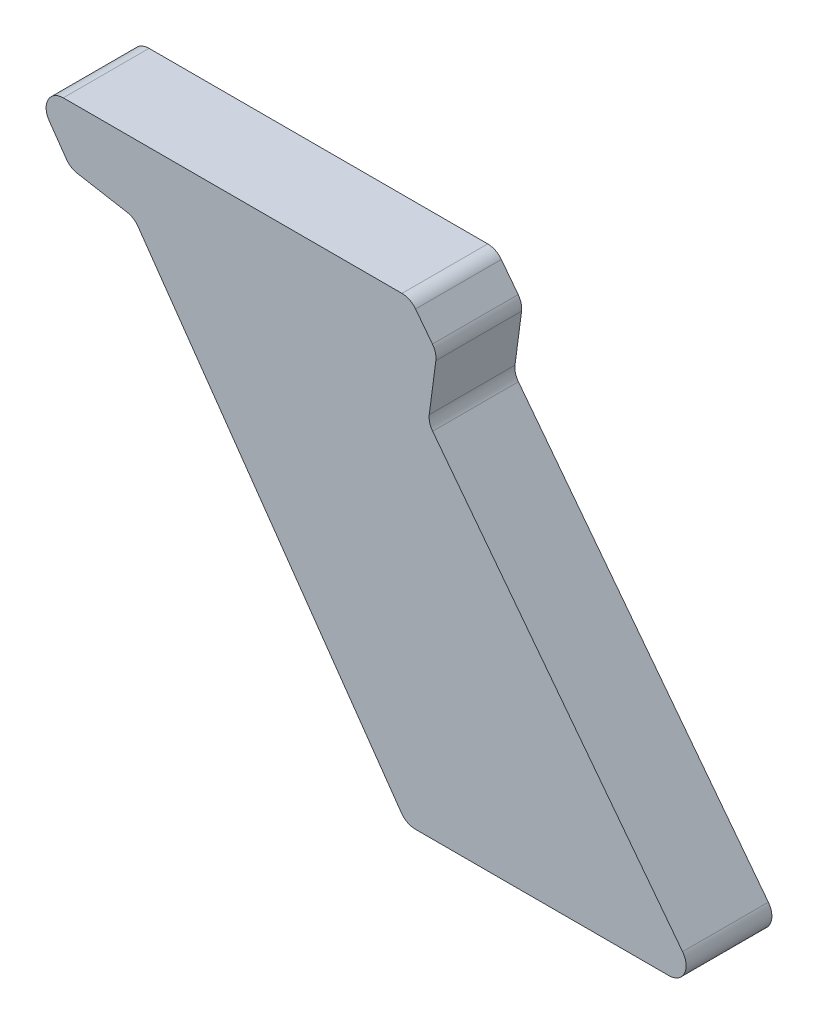
ISO-10303-21;
HEADER;
FILE_DESCRIPTION(('STEP AP214'),'2;1');
FILE_NAME('part.step','',(''),(''),'','','');
FILE_SCHEMA(('AUTOMOTIVE_DESIGN { 1 0 10303 214 1 1 1 1 }'));
ENDSEC;
DATA;
#1=APPLICATION_CONTEXT('core data for automotive mechanical design processes');
#2=APPLICATION_PROTOCOL_DEFINITION('international standard','automotive_design',2000,#1);
#3=PRODUCT_CONTEXT('',#1,'mechanical');
#4=PRODUCT('Part','Part','',(#3));
#5=PRODUCT_RELATED_PRODUCT_CATEGORY('part','',(#4));
#6=PRODUCT_DEFINITION_FORMATION('','',#4);
#7=PRODUCT_DEFINITION_CONTEXT('part definition',#1,'design');
#8=PRODUCT_DEFINITION('design','',#6,#7);
#9=PRODUCT_DEFINITION_SHAPE('','',#8);
#10=(LENGTH_UNIT() NAMED_UNIT(*) SI_UNIT(.MILLI.,.METRE.));
#11=(NAMED_UNIT(*) PLANE_ANGLE_UNIT() SI_UNIT($,.RADIAN.));
#12=(NAMED_UNIT(*) SI_UNIT($,.STERADIAN.) SOLID_ANGLE_UNIT());
#13=UNCERTAINTY_MEASURE_WITH_UNIT(LENGTH_MEASURE(1.E-05),#10,'distance_accuracy_value','');
#14=(GEOMETRIC_REPRESENTATION_CONTEXT(3) GLOBAL_UNCERTAINTY_ASSIGNED_CONTEXT((#13)) GLOBAL_UNIT_ASSIGNED_CONTEXT((#10,
#11,#12)) REPRESENTATION_CONTEXT('',''));
#15=CARTESIAN_POINT('',(0.,0.,0.));
#16=DIRECTION('',(0.,0.,1.));
#17=DIRECTION('',(1.,0.,0.));
#18=AXIS2_PLACEMENT_3D('',#15,#16,#17);
#19=CARTESIAN_POINT('',(-52.7818160043293,77.,15.));
#20=DIRECTION('',(0.,0.,-1.));
#21=DIRECTION('',(-1.,0.,0.));
#22=AXIS2_PLACEMENT_3D('',#19,#20,#21);
#23=CYLINDRICAL_SURFACE('',#22,3.);
#24=CARTESIAN_POINT('',(-52.7818160043293,77.,0.));
#25=DIRECTION('',(0.,0.,1.));
#26=DIRECTION('',(1.,0.,0.));
#27=AXIS2_PLACEMENT_3D('',#24,#25,#26);
#28=CIRCLE('',#27,3.);
#29=CARTESIAN_POINT('',(-50.4017559834556,78.8262842870262,0.));
#30=VERTEX_POINT('',#29);
#31=CARTESIAN_POINT('',(-52.7818160043293,80.,0.));
#32=VERTEX_POINT('',#31);
#33=EDGE_CURVE('E182',#30,#32,#28,.T.);
#34=ORIENTED_EDGE('',*,*,#33,.T.);
#35=DIRECTION('',(0.,0.,-1.));
#36=VECTOR('',#35,1.);
#37=CARTESIAN_POINT('',(-52.7818160043293,80.,15.));
#38=LINE('',#37,#36);
#39=CARTESIAN_POINT('',(-52.7818160043293,80.,15.));
#40=VERTEX_POINT('',#39);
#41=EDGE_CURVE('E11',#40,#32,#38,.T.);
#42=ORIENTED_EDGE('',*,*,#41,.F.);
#43=CARTESIAN_POINT('',(-52.7818160043293,77.,15.));
#44=DIRECTION('',(0.,0.,1.));
#45=DIRECTION('',(1.,0.,0.));
#46=AXIS2_PLACEMENT_3D('',#43,#44,#45);
#47=CIRCLE('',#46,3.);
#48=CARTESIAN_POINT('',(-50.4017559834556,78.8262842870262,15.));
#49=VERTEX_POINT('',#48);
#50=EDGE_CURVE('E212',#49,#40,#47,.T.);
#51=ORIENTED_EDGE('',*,*,#50,.F.);
#52=DIRECTION('',(0.,0.,-1.));
#53=VECTOR('',#52,1.);
#54=CARTESIAN_POINT('',(-50.4017559834556,78.8262842870262,15.));
#55=LINE('',#54,#53);
#56=EDGE_CURVE('E178',#49,#30,#55,.T.);
#57=ORIENTED_EDGE('',*,*,#56,.T.);
#58=EDGE_LOOP('',(#34,#42,#51,#57));
#59=FACE_BOUND('',#58,.T.);
#60=ADVANCED_FACE('F38',(#59),#23,.T.);
#61=CARTESIAN_POINT('',(-52.7818160043293,80.,15.));
#62=DIRECTION('',(0.,-1.,0.));
#63=DIRECTION('',(1.,0.,0.));
#64=AXIS2_PLACEMENT_3D('',#61,#62,#63);
#65=PLANE('',#64);
#66=DIRECTION('',(-1.,0.,0.));
#67=VECTOR('',#66,1.);
#68=CARTESIAN_POINT('',(-52.7818160043293,80.,0.));
#69=LINE('',#68,#67);
#70=CARTESIAN_POINT('',(-112.019853385957,80.,0.));
#71=VERTEX_POINT('',#70);
#72=EDGE_CURVE('E185',#32,#71,#69,.T.);
#73=ORIENTED_EDGE('',*,*,#72,.T.);
#74=DIRECTION('',(0.,0.,-1.));
#75=VECTOR('',#74,1.);
#76=CARTESIAN_POINT('',(-112.019853385957,80.,15.));
#77=LINE('',#76,#75);
#78=CARTESIAN_POINT('',(-112.019853385957,80.,15.));
#79=VERTEX_POINT('',#78);
#80=EDGE_CURVE('E46',#79,#71,#77,.T.);
#81=ORIENTED_EDGE('',*,*,#80,.F.);
#82=DIRECTION('',(-1.,0.,0.));
#83=VECTOR('',#82,1.);
#84=CARTESIAN_POINT('',(-52.7818160043293,80.,15.));
#85=LINE('',#84,#83);
#86=EDGE_CURVE('E121',#40,#79,#85,.T.);
#87=ORIENTED_EDGE('',*,*,#86,.F.);
#88=ORIENTED_EDGE('',*,*,#41,.T.);
#89=EDGE_LOOP('',(#73,#81,#87,#88));
#90=FACE_BOUND('',#89,.T.);
#91=ADVANCED_FACE('F310',(#90),#65,.F.);
#92=CARTESIAN_POINT('',(-112.019853385957,77.,15.));
#93=DIRECTION('',(0.,0.,-1.));
#94=DIRECTION('',(-1.,0.,0.));
#95=AXIS2_PLACEMENT_3D('',#92,#93,#94);
#96=CYLINDRICAL_SURFACE('',#95,2.99999999999999);
#97=CARTESIAN_POINT('',(-112.019853385957,77.,0.));
#98=DIRECTION('',(0.,0.,1.));
#99=DIRECTION('',(1.,0.,0.));
#100=AXIS2_PLACEMENT_3D('',#97,#98,#99);
#101=CIRCLE('',#100,2.99999999999999);
#102=CARTESIAN_POINT('',(-114.477309518823,75.2792706909468,0.));
#103=VERTEX_POINT('',#102);
#104=EDGE_CURVE('E187',#71,#103,#101,.T.);
#105=ORIENTED_EDGE('',*,*,#104,.T.);
#106=DIRECTION('',(0.,0.,-1.));
#107=VECTOR('',#106,1.);
#108=CARTESIAN_POINT('',(-114.477309518823,75.2792706909468,15.));
#109=LINE('',#108,#107);
#110=CARTESIAN_POINT('',(-114.477309518823,75.2792706909468,15.));
#111=VERTEX_POINT('',#110);
#112=EDGE_CURVE('E243',#111,#103,#109,.T.);
#113=ORIENTED_EDGE('',*,*,#112,.F.);
#114=CARTESIAN_POINT('',(-112.019853385957,77.,15.));
#115=DIRECTION('',(0.,0.,1.));
#116=DIRECTION('',(1.,0.,0.));
#117=AXIS2_PLACEMENT_3D('',#114,#115,#116);
#118=CIRCLE('',#117,2.99999999999999);
#119=EDGE_CURVE('E251',#79,#111,#118,.T.);
#120=ORIENTED_EDGE('',*,*,#119,.F.);
#121=ORIENTED_EDGE('',*,*,#80,.T.);
#122=EDGE_LOOP('',(#105,#113,#120,#121));
#123=FACE_BOUND('',#122,.T.);
#124=ADVANCED_FACE('F249',(#123),#96,.T.);
#125=CARTESIAN_POINT('',(-114.477309518823,75.2792706909468,15.));
#126=DIRECTION('',(0.819152044288985,0.573576436351057,0.));
#127=DIRECTION('',(-0.573576436351057,0.819152044288985,0.));
#128=AXIS2_PLACEMENT_3D('',#125,#126,#127);
#129=PLANE('',#128);
#130=DIRECTION('',(0.573576436351056,-0.819152044288984,0.));
#131=VECTOR('',#130,1.);
#132=CARTESIAN_POINT('',(-114.477309518823,75.2792706909468,0.));
#133=LINE('',#132,#131);
#134=CARTESIAN_POINT('',(-111.493473801756,71.0179116591704,0.));
#135=VERTEX_POINT('',#134);
#136=EDGE_CURVE('E189',#103,#135,#133,.T.);
#137=ORIENTED_EDGE('',*,*,#136,.T.);
#138=DIRECTION('',(0.,0.,-1.));
#139=VECTOR('',#138,1.);
#140=CARTESIAN_POINT('',(-111.493473801756,71.0179116591704,15.));
#141=LINE('',#140,#139);
#142=CARTESIAN_POINT('',(-111.493473801756,71.0179116591704,15.));
#143=VERTEX_POINT('',#142);
#144=EDGE_CURVE('E240',#143,#135,#141,.T.);
#145=ORIENTED_EDGE('',*,*,#144,.F.);
#146=DIRECTION('',(0.573576436351056,-0.819152044288984,0.));
#147=VECTOR('',#146,1.);
#148=CARTESIAN_POINT('',(-114.477309518823,75.2792706909468,15.));
#149=LINE('',#148,#147);
#150=EDGE_CURVE('E269',#111,#143,#149,.T.);
#151=ORIENTED_EDGE('',*,*,#150,.F.);
#152=ORIENTED_EDGE('',*,*,#112,.T.);
#153=EDGE_LOOP('',(#137,#145,#151,#152));
#154=FACE_BOUND('',#153,.T.);
#155=ADVANCED_FACE('F260',(#154),#129,.F.);
#156=CARTESIAN_POINT('',(-109.036017668889,72.7386409682236,15.));
#157=DIRECTION('',(0.,0.,-1.));
#158=DIRECTION('',(-1.,0.,0.));
#159=AXIS2_PLACEMENT_3D('',#156,#157,#158);
#160=CYLINDRICAL_SURFACE('',#159,3.);
#161=CARTESIAN_POINT('',(-109.036017668889,72.7386409682236,0.));
#162=DIRECTION('',(0.,0.,1.));
#163=DIRECTION('',(1.,0.,0.));
#164=AXIS2_PLACEMENT_3D('',#161,#162,#163);
#165=CIRCLE('',#164,3.);
#166=CARTESIAN_POINT('',(-109.556962201889,69.784217709187,0.));
#167=VERTEX_POINT('',#166);
#168=EDGE_CURVE('E191',#135,#167,#165,.T.);
#169=ORIENTED_EDGE('',*,*,#168,.T.);
#170=DIRECTION('',(0.,0.,-1.));
#171=VECTOR('',#170,1.);
#172=CARTESIAN_POINT('',(-109.556962201889,69.784217709187,15.));
#173=LINE('',#172,#171);
#174=CARTESIAN_POINT('',(-109.556962201889,69.784217709187,15.));
#175=VERTEX_POINT('',#174);
#176=EDGE_CURVE('E237',#175,#167,#173,.T.);
#177=ORIENTED_EDGE('',*,*,#176,.F.);
#178=CARTESIAN_POINT('',(-109.036017668889,72.7386409682236,15.));
#179=DIRECTION('',(0.,0.,1.));
#180=DIRECTION('',(1.,0.,0.));
#181=AXIS2_PLACEMENT_3D('',#178,#179,#180);
#182=CIRCLE('',#181,3.);
#183=EDGE_CURVE('E266',#143,#175,#182,.T.);
#184=ORIENTED_EDGE('',*,*,#183,.F.);
#185=ORIENTED_EDGE('',*,*,#144,.T.);
#186=EDGE_LOOP('',(#169,#177,#184,#185));
#187=FACE_BOUND('',#186,.T.);
#188=ADVANCED_FACE('F264',(#187),#160,.T.);
#189=CARTESIAN_POINT('',(-109.556962201889,69.784217709187,15.));
#190=DIRECTION('',(0.173648177666915,0.984807753012211,0.));
#191=DIRECTION('',(-0.984807753012211,0.173648177666915,0.));
#192=AXIS2_PLACEMENT_3D('',#189,#190,#191);
#193=PLANE('',#192);
#194=DIRECTION('',(0.984807753012211,-0.173648177666915,0.));
#195=VECTOR('',#194,1.);
#196=CARTESIAN_POINT('',(-109.556962201889,69.784217709187,0.));
#197=LINE('',#196,#195);
#198=CARTESIAN_POINT('',(-100.862658722536,68.2511774273096,0.));
#199=VERTEX_POINT('',#198);
#200=EDGE_CURVE('E193',#167,#199,#197,.T.);
#201=ORIENTED_EDGE('',*,*,#200,.T.);
#202=DIRECTION('',(0.,0.,-1.));
#203=VECTOR('',#202,1.);
#204=CARTESIAN_POINT('',(-100.862658722536,68.2511774273096,15.));
#205=LINE('',#204,#203);
#206=CARTESIAN_POINT('',(-100.862658722536,68.2511774273096,15.));
#207=VERTEX_POINT('',#206);
#208=EDGE_CURVE('E234',#207,#199,#205,.T.);
#209=ORIENTED_EDGE('',*,*,#208,.F.);
#210=DIRECTION('',(0.984807753012211,-0.173648177666915,0.));
#211=VECTOR('',#210,1.);
#212=CARTESIAN_POINT('',(-109.556962201889,69.784217709187,15.));
#213=LINE('',#212,#211);
#214=EDGE_CURVE('E268',#175,#207,#213,.T.);
#215=ORIENTED_EDGE('',*,*,#214,.F.);
#216=ORIENTED_EDGE('',*,*,#176,.T.);
#217=EDGE_LOOP('',(#201,#209,#215,#216));
#218=FACE_BOUND('',#217,.T.);
#219=ADVANCED_FACE('F323',(#218),#193,.F.);
#220=CARTESIAN_POINT('',(-101.383603255537,65.296754168273,15.));
#221=DIRECTION('',(0.,0.,-1.));
#222=DIRECTION('',(-1.,0.,0.));
#223=AXIS2_PLACEMENT_3D('',#220,#221,#222);
#224=CYLINDRICAL_SURFACE('',#223,2.99999999999999);
#225=CARTESIAN_POINT('',(-101.383603255537,65.296754168273,0.));
#226=DIRECTION('',(0.,0.,-1.));
#227=DIRECTION('',(-1.,0.,0.));
#228=AXIS2_PLACEMENT_3D('',#225,#226,#227);
#229=CIRCLE('',#228,2.99999999999999);
#230=CARTESIAN_POINT('',(-98.9261471226698,67.0174834773262,0.));
#231=VERTEX_POINT('',#230);
#232=EDGE_CURVE('E195',#199,#231,#229,.T.);
#233=ORIENTED_EDGE('',*,*,#232,.T.);
#234=DIRECTION('',(0.,0.,-1.));
#235=VECTOR('',#234,1.);
#236=CARTESIAN_POINT('',(-98.9261471226698,67.0174834773262,15.));
#237=LINE('',#236,#235);
#238=CARTESIAN_POINT('',(-98.9261471226698,67.0174834773262,15.));
#239=VERTEX_POINT('',#238);
#240=EDGE_CURVE('E231',#239,#231,#237,.T.);
#241=ORIENTED_EDGE('',*,*,#240,.F.);
#242=CARTESIAN_POINT('',(-101.383603255537,65.296754168273,15.));
#243=DIRECTION('',(0.,0.,-1.));
#244=DIRECTION('',(-1.,0.,0.));
#245=AXIS2_PLACEMENT_3D('',#242,#243,#244);
#246=CIRCLE('',#245,2.99999999999999);
#247=EDGE_CURVE('E271',#207,#239,#246,.T.);
#248=ORIENTED_EDGE('',*,*,#247,.F.);
#249=ORIENTED_EDGE('',*,*,#208,.T.);
#250=EDGE_LOOP('',(#233,#241,#248,#249));
#251=FACE_BOUND('',#250,.T.);
#252=ADVANCED_FACE('F326',(#251),#224,.F.);
#253=CARTESIAN_POINT('',(-98.9261471226698,67.0174834773262,15.));
#254=DIRECTION('',(0.819152044288984,0.573576436351057,0.));
#255=DIRECTION('',(-0.573576436351057,0.819152044288984,0.));
#256=AXIS2_PLACEMENT_3D('',#253,#254,#255);
#257=PLANE('',#256);
#258=DIRECTION('',(0.573576436351057,-0.819152044288984,0.));
#259=VECTOR('',#258,1.);
#260=CARTESIAN_POINT('',(-98.9261471226698,67.0174834773262,0.));
#261=LINE('',#260,#259);
#262=CARTESIAN_POINT('',(-52.8957549812117,1.27927069094683,0.));
#263=VERTEX_POINT('',#262);
#264=EDGE_CURVE('E197',#231,#263,#261,.T.);
#265=ORIENTED_EDGE('',*,*,#264,.T.);
#266=DIRECTION('',(0.,0.,-1.));
#267=VECTOR('',#266,1.);
#268=CARTESIAN_POINT('',(-52.8957549812117,1.27927069094683,15.));
#269=LINE('',#268,#267);
#270=CARTESIAN_POINT('',(-52.8957549812117,1.27927069094683,15.));
#271=VERTEX_POINT('',#270);
#272=EDGE_CURVE('E228',#271,#263,#269,.T.);
#273=ORIENTED_EDGE('',*,*,#272,.F.);
#274=DIRECTION('',(0.573576436351057,-0.819152044288984,0.));
#275=VECTOR('',#274,1.);
#276=CARTESIAN_POINT('',(-98.9261471226698,67.0174834773262,15.));
#277=LINE('',#276,#275);
#278=EDGE_CURVE('E277',#239,#271,#277,.T.);
#279=ORIENTED_EDGE('',*,*,#278,.F.);
#280=ORIENTED_EDGE('',*,*,#240,.T.);
#281=EDGE_LOOP('',(#265,#273,#279,#280));
#282=FACE_BOUND('',#281,.T.);
#283=ADVANCED_FACE('F330',(#282),#257,.F.);
#284=CARTESIAN_POINT('',(-50.4382988483448,3.,15.));
#285=DIRECTION('',(0.,0.,-1.));
#286=DIRECTION('',(-1.,0.,0.));
#287=AXIS2_PLACEMENT_3D('',#284,#285,#286);
#288=CYLINDRICAL_SURFACE('',#287,2.99999999999999);
#289=CARTESIAN_POINT('',(-50.4382988483448,3.,0.));
#290=DIRECTION('',(0.,0.,1.));
#291=DIRECTION('',(1.,0.,0.));
#292=AXIS2_PLACEMENT_3D('',#289,#290,#291);
#293=CIRCLE('',#292,2.99999999999999);
#294=CARTESIAN_POINT('',(-50.4382988483448,0.,0.));
#295=VERTEX_POINT('',#294);
#296=EDGE_CURVE('E199',#263,#295,#293,.T.);
#297=ORIENTED_EDGE('',*,*,#296,.T.);
#298=DIRECTION('',(0.,0.,-1.));
#299=VECTOR('',#298,1.);
#300=CARTESIAN_POINT('',(-50.4382988483448,0.,15.));
#301=LINE('',#300,#299);
#302=CARTESIAN_POINT('',(-50.4382988483448,0.,15.));
#303=VERTEX_POINT('',#302);
#304=EDGE_CURVE('E225',#303,#295,#301,.T.);
#305=ORIENTED_EDGE('',*,*,#304,.F.);
#306=CARTESIAN_POINT('',(-50.4382988483448,3.,15.));
#307=DIRECTION('',(0.,0.,1.));
#308=DIRECTION('',(1.,0.,0.));
#309=AXIS2_PLACEMENT_3D('',#306,#307,#308);
#310=CIRCLE('',#309,2.99999999999999);
#311=EDGE_CURVE('E279',#271,#303,#310,.T.);
#312=ORIENTED_EDGE('',*,*,#311,.F.);
#313=ORIENTED_EDGE('',*,*,#272,.T.);
#314=EDGE_LOOP('',(#297,#305,#312,#313));
#315=FACE_BOUND('',#314,.T.);
#316=ADVANCED_FACE('F334',(#315),#288,.T.);
#317=CARTESIAN_POINT('',(-50.4382988483448,0.,15.));
#318=DIRECTION('',(0.,1.,0.));
#319=DIRECTION('',(0.,0.,1.));
#320=AXIS2_PLACEMENT_3D('',#317,#318,#319);
#321=PLANE('',#320);
#322=DIRECTION('',(1.,0.,0.));
#323=VECTOR('',#322,1.);
#324=CARTESIAN_POINT('',(-50.4382988483448,0.,0.));
#325=LINE('',#324,#323);
#326=CARTESIAN_POINT('',(-6.08339820596772,0.,0.));
#327=VERTEX_POINT('',#326);
#328=EDGE_CURVE('E201',#295,#327,#325,.T.);
#329=ORIENTED_EDGE('',*,*,#328,.T.);
#330=DIRECTION('',(0.,0.,-1.));
#331=VECTOR('',#330,1.);
#332=CARTESIAN_POINT('',(-6.08339820596772,0.,15.));
#333=LINE('',#332,#331);
#334=CARTESIAN_POINT('',(-6.08339820596772,0.,15.));
#335=VERTEX_POINT('',#334);
#336=EDGE_CURVE('E222',#335,#327,#333,.T.);
#337=ORIENTED_EDGE('',*,*,#336,.F.);
#338=DIRECTION('',(1.,0.,0.));
#339=VECTOR('',#338,1.);
#340=CARTESIAN_POINT('',(-50.4382988483448,0.,15.));
#341=LINE('',#340,#339);
#342=EDGE_CURVE('E281',#303,#335,#341,.T.);
#343=ORIENTED_EDGE('',*,*,#342,.F.);
#344=ORIENTED_EDGE('',*,*,#304,.T.);
#345=EDGE_LOOP('',(#329,#337,#343,#344));
#346=FACE_BOUND('',#345,.T.);
#347=ADVANCED_FACE('F338',(#346),#321,.F.);
#348=CARTESIAN_POINT('',(-6.08339820596772,3.,15.));
#349=DIRECTION('',(0.,0.,-1.));
#350=DIRECTION('',(-1.,0.,0.));
#351=AXIS2_PLACEMENT_3D('',#348,#349,#350);
#352=CYLINDRICAL_SURFACE('',#351,3.);
#353=CARTESIAN_POINT('',(-6.08339820596772,3.,0.));
#354=DIRECTION('',(0.,0.,1.));
#355=DIRECTION('',(1.,0.,0.));
#356=AXIS2_PLACEMENT_3D('',#353,#354,#355);
#357=CIRCLE('',#356,3.);
#358=CARTESIAN_POINT('',(-3.70333818509402,4.82628428702618,0.));
#359=VERTEX_POINT('',#358);
#360=EDGE_CURVE('E203',#327,#359,#357,.T.);
#361=ORIENTED_EDGE('',*,*,#360,.T.);
#362=DIRECTION('',(0.,0.,-1.));
#363=VECTOR('',#362,1.);
#364=CARTESIAN_POINT('',(-3.70333818509402,4.82628428702618,15.));
#365=LINE('',#364,#363);
#366=CARTESIAN_POINT('',(-3.70333818509402,4.82628428702618,15.));
#367=VERTEX_POINT('',#366);
#368=EDGE_CURVE('E219',#367,#359,#365,.T.);
#369=ORIENTED_EDGE('',*,*,#368,.F.);
#370=CARTESIAN_POINT('',(-6.08339820596772,3.,15.));
#371=DIRECTION('',(0.,0.,1.));
#372=DIRECTION('',(1.,0.,0.));
#373=AXIS2_PLACEMENT_3D('',#370,#371,#372);
#374=CIRCLE('',#373,3.);
#375=EDGE_CURVE('E283',#335,#367,#374,.T.);
#376=ORIENTED_EDGE('',*,*,#375,.F.);
#377=ORIENTED_EDGE('',*,*,#336,.T.);
#378=EDGE_LOOP('',(#361,#369,#376,#377));
#379=FACE_BOUND('',#378,.T.);
#380=ADVANCED_FACE('F342',(#379),#352,.T.);
#381=CARTESIAN_POINT('',(-3.70333818509402,4.82628428702618,15.));
#382=DIRECTION('',(-0.793353340291232,-0.608761429008725,0.));
#383=DIRECTION('',(0.608761429008725,-0.793353340291232,0.));
#384=AXIS2_PLACEMENT_3D('',#381,#382,#383);
#385=PLANE('',#384);
#386=DIRECTION('',(-0.608761429008725,0.793353340291232,0.));
#387=VECTOR('',#386,1.);
#388=CARTESIAN_POINT('',(-3.70333818509402,4.82628428702618,0.));
#389=LINE('',#388,#387);
#390=CARTESIAN_POINT('',(-47.4186813681865,61.7972287056925,0.));
#391=VERTEX_POINT('',#390);
#392=EDGE_CURVE('E205',#359,#391,#389,.T.);
#393=ORIENTED_EDGE('',*,*,#392,.T.);
#394=DIRECTION('',(0.,0.,-1.));
#395=VECTOR('',#394,1.);
#396=CARTESIAN_POINT('',(-47.4186813681865,61.7972287056925,15.));
#397=LINE('',#396,#395);
#398=CARTESIAN_POINT('',(-47.4186813681865,61.7972287056925,15.));
#399=VERTEX_POINT('',#398);
#400=EDGE_CURVE('E216',#399,#391,#397,.T.);
#401=ORIENTED_EDGE('',*,*,#400,.F.);
#402=DIRECTION('',(-0.608761429008725,0.793353340291232,0.));
#403=VECTOR('',#402,1.);
#404=CARTESIAN_POINT('',(-3.70333818509402,4.82628428702618,15.));
#405=LINE('',#404,#403);
#406=EDGE_CURVE('E285',#367,#399,#405,.T.);
#407=ORIENTED_EDGE('',*,*,#406,.F.);
#408=ORIENTED_EDGE('',*,*,#368,.T.);
#409=EDGE_LOOP('',(#393,#401,#407,#408));
#410=FACE_BOUND('',#409,.T.);
#411=ADVANCED_FACE('F291',(#410),#385,.F.);
#412=CARTESIAN_POINT('',(-45.0386213473128,63.6235129927187,15.));
#413=DIRECTION('',(0.,0.,-1.));
#414=DIRECTION('',(-1.,0.,0.));
#415=AXIS2_PLACEMENT_3D('',#412,#413,#414);
#416=CYLINDRICAL_SURFACE('',#415,3.);
#417=CARTESIAN_POINT('',(-45.0386213473128,63.6235129927187,0.));
#418=DIRECTION('',(0.,0.,-1.));
#419=DIRECTION('',(-1.,0.,0.));
#420=AXIS2_PLACEMENT_3D('',#417,#418,#419);
#421=CIRCLE('',#420,3.);
#422=CARTESIAN_POINT('',(-48.0129559314342,64.0150915693788,0.));
#423=VERTEX_POINT('',#422);
#424=EDGE_CURVE('E207',#391,#423,#421,.T.);
#425=ORIENTED_EDGE('',*,*,#424,.T.);
#426=DIRECTION('',(0.,0.,-1.));
#427=VECTOR('',#426,1.);
#428=CARTESIAN_POINT('',(-48.0129559314342,64.0150915693788,15.));
#429=LINE('',#428,#427);
#430=CARTESIAN_POINT('',(-48.0129559314342,64.0150915693788,15.));
#431=VERTEX_POINT('',#430);
#432=EDGE_CURVE('E173',#431,#423,#429,.T.);
#433=ORIENTED_EDGE('',*,*,#432,.F.);
#434=CARTESIAN_POINT('',(-45.0386213473128,63.6235129927187,15.));
#435=DIRECTION('',(0.,0.,-1.));
#436=DIRECTION('',(-1.,0.,0.));
#437=AXIS2_PLACEMENT_3D('',#434,#435,#436);
#438=CIRCLE('',#437,3.);
#439=EDGE_CURVE('E164',#399,#431,#438,.T.);
#440=ORIENTED_EDGE('',*,*,#439,.F.);
#441=ORIENTED_EDGE('',*,*,#400,.T.);
#442=EDGE_LOOP('',(#425,#433,#440,#441));
#443=FACE_BOUND('',#442,.T.);
#444=ADVANCED_FACE('F295',(#443),#416,.F.);
#445=CARTESIAN_POINT('',(-48.0129559314342,64.0150915693788,15.));
#446=DIRECTION('',(-0.991444861373811,0.130526192220047,0.));
#447=DIRECTION('',(-0.130526192220047,-0.991444861373811,0.));
#448=AXIS2_PLACEMENT_3D('',#445,#446,#447);
#449=PLANE('',#448);
#450=DIRECTION('',(0.130526192220047,0.991444861373811,0.));
#451=VECTOR('',#450,1.);
#452=CARTESIAN_POINT('',(-48.0129559314342,64.0150915693788,0.));
#453=LINE('',#452,#451);
#454=CARTESIAN_POINT('',(-46.8606149555489,72.7679902762216,0.));
#455=VERTEX_POINT('',#454);
#456=EDGE_CURVE('E172',#423,#455,#453,.T.);
#457=ORIENTED_EDGE('',*,*,#456,.T.);
#458=DIRECTION('',(0.,0.,-1.));
#459=VECTOR('',#458,1.);
#460=CARTESIAN_POINT('',(-46.8606149555489,72.7679902762216,15.));
#461=LINE('',#460,#459);
#462=CARTESIAN_POINT('',(-46.8606149555489,72.7679902762216,15.));
#463=VERTEX_POINT('',#462);
#464=EDGE_CURVE('E169',#463,#455,#461,.T.);
#465=ORIENTED_EDGE('',*,*,#464,.F.);
#466=DIRECTION('',(0.130526192220047,0.991444861373811,0.));
#467=VECTOR('',#466,1.);
#468=CARTESIAN_POINT('',(-48.0129559314342,64.0150915693788,15.));
#469=LINE('',#468,#467);
#470=EDGE_CURVE('E158',#431,#463,#469,.T.);
#471=ORIENTED_EDGE('',*,*,#470,.F.);
#472=ORIENTED_EDGE('',*,*,#432,.T.);
#473=EDGE_LOOP('',(#457,#465,#471,#472));
#474=FACE_BOUND('',#473,.T.);
#475=ADVANCED_FACE('F170',(#474),#449,.F.);
#476=CARTESIAN_POINT('',(-49.8349495396704,73.1595688528817,15.));
#477=DIRECTION('',(0.,0.,-1.));
#478=DIRECTION('',(-1.,0.,0.));
#479=AXIS2_PLACEMENT_3D('',#476,#477,#478);
#480=CYLINDRICAL_SURFACE('',#479,3.);
#481=CARTESIAN_POINT('',(-49.8349495396704,73.1595688528817,0.));
#482=DIRECTION('',(0.,0.,1.));
#483=DIRECTION('',(1.,0.,0.));
#484=AXIS2_PLACEMENT_3D('',#481,#482,#483);
#485=CIRCLE('',#484,3.);
#486=CARTESIAN_POINT('',(-47.4548895187967,74.9858531399079,0.));
#487=VERTEX_POINT('',#486);
#488=EDGE_CURVE('E107',#455,#487,#485,.T.);
#489=ORIENTED_EDGE('',*,*,#488,.T.);
#490=DIRECTION('',(0.,0.,-1.));
#491=VECTOR('',#490,1.);
#492=CARTESIAN_POINT('',(-47.4548895187967,74.9858531399079,15.));
#493=LINE('',#492,#491);
#494=CARTESIAN_POINT('',(-47.4548895187967,74.9858531399079,15.));
#495=VERTEX_POINT('',#494);
#496=EDGE_CURVE('E174',#495,#487,#493,.T.);
#497=ORIENTED_EDGE('',*,*,#496,.F.);
#498=CARTESIAN_POINT('',(-49.8349495396704,73.1595688528817,15.));
#499=DIRECTION('',(0.,0.,1.));
#500=DIRECTION('',(1.,0.,0.));
#501=AXIS2_PLACEMENT_3D('',#498,#499,#500);
#502=CIRCLE('',#501,3.);
#503=EDGE_CURVE('E162',#463,#495,#502,.T.);
#504=ORIENTED_EDGE('',*,*,#503,.F.);
#505=ORIENTED_EDGE('',*,*,#464,.T.);
#506=EDGE_LOOP('',(#489,#497,#504,#505));
#507=FACE_BOUND('',#506,.T.);
#508=ADVANCED_FACE('F176',(#507),#480,.T.);
#509=CARTESIAN_POINT('',(-47.4548895187967,74.9858531399079,15.));
#510=DIRECTION('',(-0.793353340291232,-0.608761429008724,0.));
#511=DIRECTION('',(0.608761429008724,-0.793353340291232,0.));
#512=AXIS2_PLACEMENT_3D('',#509,#510,#511);
#513=PLANE('',#512);
#514=DIRECTION('',(-0.608761429008725,0.793353340291232,0.));
#515=VECTOR('',#514,1.);
#516=CARTESIAN_POINT('',(-47.4548895187967,74.9858531399079,0.));
#517=LINE('',#516,#515);
#518=EDGE_CURVE('E113',#487,#30,#517,.T.);
#519=ORIENTED_EDGE('',*,*,#518,.T.);
#520=ORIENTED_EDGE('',*,*,#56,.F.);
#521=DIRECTION('',(-0.608761429008725,0.793353340291232,0.));
#522=VECTOR('',#521,1.);
#523=CARTESIAN_POINT('',(-47.4548895187967,74.9858531399079,15.));
#524=LINE('',#523,#522);
#525=EDGE_CURVE('E54',#495,#49,#524,.T.);
#526=ORIENTED_EDGE('',*,*,#525,.F.);
#527=ORIENTED_EDGE('',*,*,#496,.T.);
#528=EDGE_LOOP('',(#519,#520,#526,#527));
#529=FACE_BOUND('',#528,.T.);
#530=ADVANCED_FACE('F299',(#529),#513,.F.);
#531=CARTESIAN_POINT('',(-52.7818160043293,77.,15.));
#532=DIRECTION('',(0.,0.,1.));
#533=DIRECTION('',(1.,0.,0.));
#534=AXIS2_PLACEMENT_3D('',#531,#532,#533);
#535=PLANE('',#534);
#536=ORIENTED_EDGE('',*,*,#50,.T.);
#537=ORIENTED_EDGE('',*,*,#86,.T.);
#538=ORIENTED_EDGE('',*,*,#119,.T.);
#539=ORIENTED_EDGE('',*,*,#150,.T.);
#540=ORIENTED_EDGE('',*,*,#183,.T.);
#541=ORIENTED_EDGE('',*,*,#214,.T.);
#542=ORIENTED_EDGE('',*,*,#247,.T.);
#543=ORIENTED_EDGE('',*,*,#278,.T.);
#544=ORIENTED_EDGE('',*,*,#311,.T.);
#545=ORIENTED_EDGE('',*,*,#342,.T.);
#546=ORIENTED_EDGE('',*,*,#375,.T.);
#547=ORIENTED_EDGE('',*,*,#406,.T.);
#548=ORIENTED_EDGE('',*,*,#439,.T.);
#549=ORIENTED_EDGE('',*,*,#470,.T.);
#550=ORIENTED_EDGE('',*,*,#503,.T.);
#551=ORIENTED_EDGE('',*,*,#525,.T.);
#552=EDGE_LOOP('',(#536,#537,#538,#539,#540,#541,#542,#543,#544,#545,#546,#547,#548,#549,#550,#551));
#553=FACE_BOUND('',#552,.T.);
#554=ADVANCED_FACE('F160',(#553),#535,.T.);
#555=CARTESIAN_POINT('',(-52.7818160043293,77.,0.));
#556=DIRECTION('',(0.,0.,1.));
#557=DIRECTION('',(1.,0.,0.));
#558=AXIS2_PLACEMENT_3D('',#555,#556,#557);
#559=PLANE('',#558);
#560=ORIENTED_EDGE('',*,*,#33,.F.);
#561=ORIENTED_EDGE('',*,*,#518,.F.);
#562=ORIENTED_EDGE('',*,*,#488,.F.);
#563=ORIENTED_EDGE('',*,*,#456,.F.);
#564=ORIENTED_EDGE('',*,*,#424,.F.);
#565=ORIENTED_EDGE('',*,*,#392,.F.);
#566=ORIENTED_EDGE('',*,*,#360,.F.);
#567=ORIENTED_EDGE('',*,*,#328,.F.);
#568=ORIENTED_EDGE('',*,*,#296,.F.);
#569=ORIENTED_EDGE('',*,*,#264,.F.);
#570=ORIENTED_EDGE('',*,*,#232,.F.);
#571=ORIENTED_EDGE('',*,*,#200,.F.);
#572=ORIENTED_EDGE('',*,*,#168,.F.);
#573=ORIENTED_EDGE('',*,*,#136,.F.);
#574=ORIENTED_EDGE('',*,*,#104,.F.);
#575=ORIENTED_EDGE('',*,*,#72,.F.);
#576=EDGE_LOOP('',(#560,#561,#562,#563,#564,#565,#566,#567,#568,#569,#570,#571,#572,#573,#574,#575));
#577=FACE_BOUND('',#576,.T.);
#578=ADVANCED_FACE('F255',(#577),#559,.F.);
#579=CLOSED_SHELL('',(#60,#91,#124,#155,#188,#219,#252,#283,#316,#347,#380,#411,#444,#475,#508,
#530,#554,#578));
#580=MANIFOLD_SOLID_BREP('B2',#579);
#581=ADVANCED_BREP_SHAPE_REPRESENTATION('',(#18,#580),#14);
#582=SHAPE_DEFINITION_REPRESENTATION(#9,#581);
ENDSEC;
END-ISO-10303-21;
